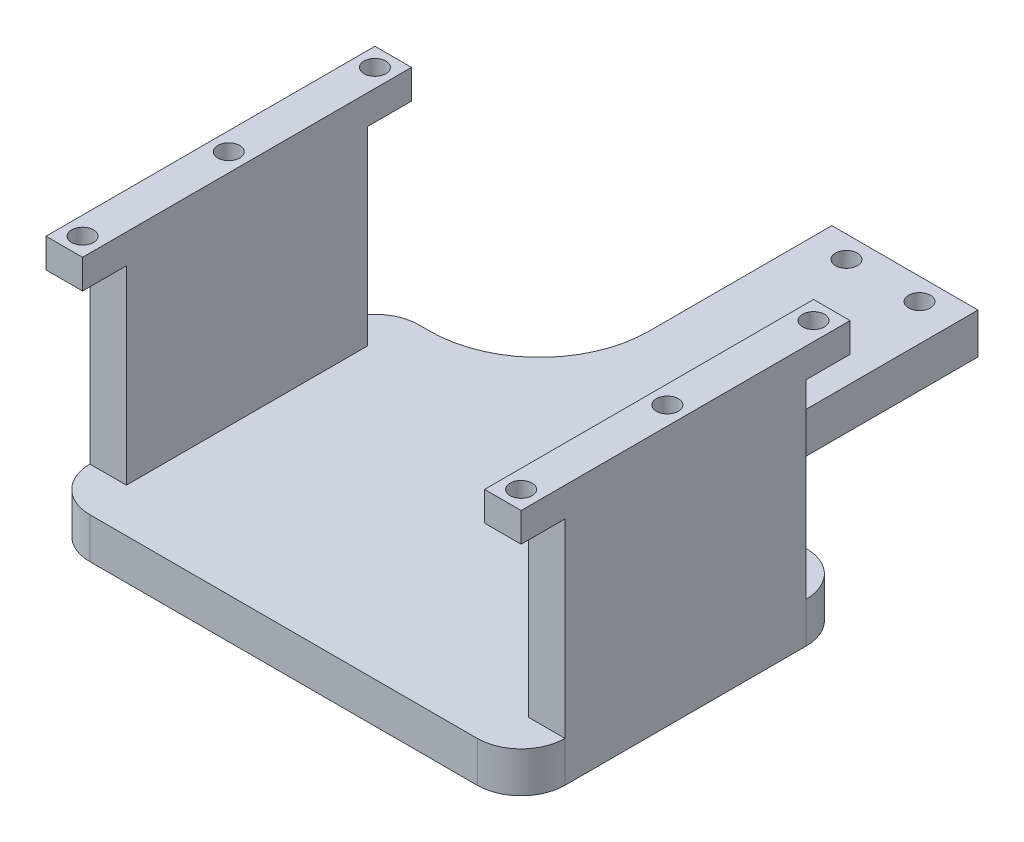
ISO-10303-21;
HEADER;
FILE_DESCRIPTION(('STEP AP214'),'2;1');
FILE_NAME('part.step','',(''),(''),'','','');
FILE_SCHEMA(('AUTOMOTIVE_DESIGN { 1 0 10303 214 1 1 1 1 }'));
ENDSEC;
DATA;
#1=APPLICATION_CONTEXT('core data for automotive mechanical design processes');
#2=APPLICATION_PROTOCOL_DEFINITION('international standard','automotive_design',2000,#1);
#3=PRODUCT_CONTEXT('',#1,'mechanical');
#4=PRODUCT('Part','Part','',(#3));
#5=PRODUCT_RELATED_PRODUCT_CATEGORY('part','',(#4));
#6=PRODUCT_DEFINITION_FORMATION('','',#4);
#7=PRODUCT_DEFINITION_CONTEXT('part definition',#1,'design');
#8=PRODUCT_DEFINITION('design','',#6,#7);
#9=PRODUCT_DEFINITION_SHAPE('','',#8);
#10=(LENGTH_UNIT() NAMED_UNIT(*) SI_UNIT(.MILLI.,.METRE.));
#11=(NAMED_UNIT(*) PLANE_ANGLE_UNIT() SI_UNIT($,.RADIAN.));
#12=(NAMED_UNIT(*) SI_UNIT($,.STERADIAN.) SOLID_ANGLE_UNIT());
#13=UNCERTAINTY_MEASURE_WITH_UNIT(LENGTH_MEASURE(1.E-05),#10,'distance_accuracy_value','');
#14=(GEOMETRIC_REPRESENTATION_CONTEXT(3) GLOBAL_UNCERTAINTY_ASSIGNED_CONTEXT((#13)) GLOBAL_UNIT_ASSIGNED_CONTEXT((#10,
#11,#12)) REPRESENTATION_CONTEXT('',''));
#15=CARTESIAN_POINT('',(0.,0.,0.));
#16=DIRECTION('',(0.,0.,1.));
#17=DIRECTION('',(1.,0.,0.));
#18=AXIS2_PLACEMENT_3D('',#15,#16,#17);
#19=CARTESIAN_POINT('',(0.,5.56,22.5));
#20=DIRECTION('',(0.,0.,-1.));
#21=DIRECTION('',(-1.,0.,0.));
#22=AXIS2_PLACEMENT_3D('',#19,#20,#21);
#23=PLANE('',#22);
#24=DIRECTION('',(1.,0.,0.));
#25=VECTOR('',#24,1.);
#26=CARTESIAN_POINT('',(0.,5.56,22.5));
#27=LINE('',#26,#25);
#28=CARTESIAN_POINT('',(-26.5,5.56,22.5));
#29=VERTEX_POINT('',#28);
#30=CARTESIAN_POINT('',(26.5,5.56,22.5));
#31=VERTEX_POINT('',#30);
#32=EDGE_CURVE('E312',#29,#31,#27,.T.);
#33=ORIENTED_EDGE('',*,*,#32,.F.);
#34=DIRECTION('',(0.,-1.,0.));
#35=VECTOR('',#34,1.);
#36=CARTESIAN_POINT('',(-26.5,0.,22.5));
#37=LINE('',#36,#35);
#38=CARTESIAN_POINT('',(-26.5,0.,22.5));
#39=VERTEX_POINT('',#38);
#40=EDGE_CURVE('E237',#29,#39,#37,.T.);
#41=ORIENTED_EDGE('',*,*,#40,.T.);
#42=DIRECTION('',(1.,0.,0.));
#43=VECTOR('',#42,1.);
#44=CARTESIAN_POINT('',(0.,0.,22.5));
#45=LINE('',#44,#43);
#46=CARTESIAN_POINT('',(26.5,0.,22.5));
#47=VERTEX_POINT('',#46);
#48=EDGE_CURVE('E289',#39,#47,#45,.T.);
#49=ORIENTED_EDGE('',*,*,#48,.T.);
#50=DIRECTION('',(0.,-1.,0.));
#51=VECTOR('',#50,1.);
#52=CARTESIAN_POINT('',(26.5,5.56,22.5));
#53=LINE('',#52,#51);
#54=EDGE_CURVE('E60',#47,#31,#53,.F.);
#55=ORIENTED_EDGE('',*,*,#54,.T.);
#56=EDGE_LOOP('',(#33,#41,#49,#55));
#57=FACE_BOUND('',#56,.T.);
#58=ADVANCED_FACE('F37',(#57),#23,.F.);
#59=DIRECTION('',(0.,-1.,0.));
#60=VECTOR('',#59,1.);
#61=CARTESIAN_POINT('',(-32.5,5.56,22.5));
#62=LINE('',#61,#60);
#63=CARTESIAN_POINT('',(-32.5,35.56,22.5));
#64=VERTEX_POINT('',#63);
#65=CARTESIAN_POINT('',(-32.5,31.56,22.5));
#66=VERTEX_POINT('',#65);
#67=EDGE_CURVE('E313',#64,#66,#62,.T.);
#68=ORIENTED_EDGE('',*,*,#67,.T.);
#69=DIRECTION('',(-1.,0.,0.));
#70=VECTOR('',#69,1.);
#71=CARTESIAN_POINT('',(32.5,31.56,22.5));
#72=LINE('',#71,#70);
#73=CARTESIAN_POINT('',(-27.5,31.56,22.5));
#74=VERTEX_POINT('',#73);
#75=EDGE_CURVE('E1107',#74,#66,#72,.T.);
#76=ORIENTED_EDGE('',*,*,#75,.F.);
#77=DIRECTION('',(0.,-1.,0.));
#78=VECTOR('',#77,1.);
#79=CARTESIAN_POINT('',(-27.5,110.836925690687,22.5));
#80=LINE('',#79,#78);
#81=CARTESIAN_POINT('',(-27.5,35.56,22.5));
#82=VERTEX_POINT('',#81);
#83=EDGE_CURVE('E455',#82,#74,#80,.T.);
#84=ORIENTED_EDGE('',*,*,#83,.F.);
#85=DIRECTION('',(1.,0.,0.));
#86=VECTOR('',#85,1.);
#87=CARTESIAN_POINT('',(0.,35.56,22.5));
#88=LINE('',#87,#86);
#89=EDGE_CURVE('E442',#64,#82,#88,.T.);
#90=ORIENTED_EDGE('',*,*,#89,.F.);
#91=EDGE_LOOP('',(#68,#76,#84,#90));
#92=FACE_BOUND('',#91,.T.);
#93=ADVANCED_FACE('F513',(#92),#23,.F.);
#94=CARTESIAN_POINT('',(0.,5.56,-22.5));
#95=DIRECTION('',(0.,0.,-1.));
#96=DIRECTION('',(-1.,0.,0.));
#97=AXIS2_PLACEMENT_3D('',#94,#95,#96);
#98=PLANE('',#97);
#99=DIRECTION('',(-1.,0.,0.));
#100=VECTOR('',#99,1.);
#101=CARTESIAN_POINT('',(32.5,31.56,-22.5));
#102=LINE('',#101,#100);
#103=CARTESIAN_POINT('',(32.5,31.56,-22.5));
#104=VERTEX_POINT('',#103);
#105=CARTESIAN_POINT('',(27.5,31.56,-22.5));
#106=VERTEX_POINT('',#105);
#107=EDGE_CURVE('E337',#104,#106,#102,.T.);
#108=ORIENTED_EDGE('',*,*,#107,.T.);
#109=DIRECTION('',(0.,-1.,0.));
#110=VECTOR('',#109,1.);
#111=CARTESIAN_POINT('',(27.5,110.836925690687,-22.5));
#112=LINE('',#111,#110);
#113=CARTESIAN_POINT('',(27.5,35.56,-22.5));
#114=VERTEX_POINT('',#113);
#115=EDGE_CURVE('E406',#114,#106,#112,.T.);
#116=ORIENTED_EDGE('',*,*,#115,.F.);
#117=DIRECTION('',(1.,0.,0.));
#118=VECTOR('',#117,1.);
#119=CARTESIAN_POINT('',(0.,35.56,-22.5));
#120=LINE('',#119,#118);
#121=CARTESIAN_POINT('',(32.5,35.56,-22.5));
#122=VERTEX_POINT('',#121);
#123=EDGE_CURVE('E403',#114,#122,#120,.T.);
#124=ORIENTED_EDGE('',*,*,#123,.T.);
#125=DIRECTION('',(0.,-1.,0.));
#126=VECTOR('',#125,1.);
#127=CARTESIAN_POINT('',(32.5,5.56,-22.5));
#128=LINE('',#127,#126);
#129=EDGE_CURVE('E326',#122,#104,#128,.T.);
#130=ORIENTED_EDGE('',*,*,#129,.T.);
#131=EDGE_LOOP('',(#108,#116,#124,#130));
#132=FACE_BOUND('',#131,.T.);
#133=ADVANCED_FACE('F521',(#132),#98,.T.);
#134=CARTESIAN_POINT('',(-27.5,31.56,-22.5));
#135=VERTEX_POINT('',#134);
#136=CARTESIAN_POINT('',(-32.5,31.56,-22.5));
#137=VERTEX_POINT('',#136);
#138=EDGE_CURVE('E1105',#135,#137,#102,.T.);
#139=ORIENTED_EDGE('',*,*,#138,.T.);
#140=DIRECTION('',(0.,-1.,0.));
#141=VECTOR('',#140,1.);
#142=CARTESIAN_POINT('',(-32.5,5.56,-22.5));
#143=LINE('',#142,#141);
#144=CARTESIAN_POINT('',(-32.5,35.56,-22.5));
#145=VERTEX_POINT('',#144);
#146=EDGE_CURVE('E316',#145,#137,#143,.T.);
#147=ORIENTED_EDGE('',*,*,#146,.F.);
#148=DIRECTION('',(1.,0.,0.));
#149=VECTOR('',#148,1.);
#150=CARTESIAN_POINT('',(0.,35.56,-22.5));
#151=LINE('',#150,#149);
#152=CARTESIAN_POINT('',(-27.5,35.56,-22.5));
#153=VERTEX_POINT('',#152);
#154=EDGE_CURVE('E453',#145,#153,#151,.T.);
#155=ORIENTED_EDGE('',*,*,#154,.T.);
#156=DIRECTION('',(0.,-1.,0.));
#157=VECTOR('',#156,1.);
#158=CARTESIAN_POINT('',(-27.5,110.836925690687,-22.5));
#159=LINE('',#158,#157);
#160=EDGE_CURVE('E452',#153,#135,#159,.T.);
#161=ORIENTED_EDGE('',*,*,#160,.T.);
#162=EDGE_LOOP('',(#139,#147,#155,#161));
#163=FACE_BOUND('',#162,.T.);
#164=ADVANCED_FACE('F526',(#163),#98,.T.);
#165=DIRECTION('',(0.,-1.,0.));
#166=VECTOR('',#165,1.);
#167=CARTESIAN_POINT('',(27.5,110.836925690687,22.5));
#168=LINE('',#167,#166);
#169=CARTESIAN_POINT('',(27.5,35.56,22.5));
#170=VERTEX_POINT('',#169);
#171=CARTESIAN_POINT('',(27.5,31.56,22.5));
#172=VERTEX_POINT('',#171);
#173=EDGE_CURVE('E422',#170,#172,#168,.T.);
#174=ORIENTED_EDGE('',*,*,#173,.T.);
#175=CARTESIAN_POINT('',(32.5,31.56,22.5));
#176=VERTEX_POINT('',#175);
#177=EDGE_CURVE('E537',#176,#172,#72,.T.);
#178=ORIENTED_EDGE('',*,*,#177,.F.);
#179=DIRECTION('',(0.,-1.,0.));
#180=VECTOR('',#179,1.);
#181=CARTESIAN_POINT('',(32.5,5.56,22.5));
#182=LINE('',#181,#180);
#183=CARTESIAN_POINT('',(32.5,35.56,22.5));
#184=VERTEX_POINT('',#183);
#185=EDGE_CURVE('E329',#184,#176,#182,.T.);
#186=ORIENTED_EDGE('',*,*,#185,.F.);
#187=DIRECTION('',(1.,0.,0.));
#188=VECTOR('',#187,1.);
#189=CARTESIAN_POINT('',(0.,35.56,22.5));
#190=LINE('',#189,#188);
#191=EDGE_CURVE('E423',#170,#184,#190,.T.);
#192=ORIENTED_EDGE('',*,*,#191,.F.);
#193=EDGE_LOOP('',(#174,#178,#186,#192));
#194=FACE_BOUND('',#193,.T.);
#195=ADVANCED_FACE('F515',(#194),#23,.F.);
#196=CARTESIAN_POINT('',(32.5,5.56,0.));
#197=DIRECTION('',(-1.,0.,0.));
#198=DIRECTION('',(0.,0.,1.));
#199=AXIS2_PLACEMENT_3D('',#196,#197,#198);
#200=PLANE('',#199);
#201=DIRECTION('',(0.,-1.,0.));
#202=VECTOR('',#201,1.);
#203=CARTESIAN_POINT('',(32.5,5.56,16.5));
#204=LINE('',#203,#202);
#205=CARTESIAN_POINT('',(32.5,31.56,16.5));
#206=VERTEX_POINT('',#205);
#207=CARTESIAN_POINT('',(32.5,5.56,16.5));
#208=VERTEX_POINT('',#207);
#209=EDGE_CURVE('E277',#206,#208,#204,.T.);
#210=ORIENTED_EDGE('',*,*,#209,.T.);
#211=DIRECTION('',(0.,-1.,0.));
#212=VECTOR('',#211,1.);
#213=CARTESIAN_POINT('',(32.5,5.56,16.5));
#214=LINE('',#213,#212);
#215=CARTESIAN_POINT('',(32.5,0.,16.5));
#216=VERTEX_POINT('',#215);
#217=EDGE_CURVE('E45',#208,#216,#214,.T.);
#218=ORIENTED_EDGE('',*,*,#217,.T.);
#219=DIRECTION('',(0.,0.,-1.));
#220=VECTOR('',#219,1.);
#221=CARTESIAN_POINT('',(32.5,0.,0.));
#222=LINE('',#221,#220);
#223=CARTESIAN_POINT('',(32.5,0.,-16.5));
#224=VERTEX_POINT('',#223);
#225=EDGE_CURVE('E235',#216,#224,#222,.T.);
#226=ORIENTED_EDGE('',*,*,#225,.T.);
#227=DIRECTION('',(0.,-1.,0.));
#228=VECTOR('',#227,1.);
#229=CARTESIAN_POINT('',(32.5,5.56,-16.5));
#230=LINE('',#229,#228);
#231=CARTESIAN_POINT('',(32.5,5.56,-16.5));
#232=VERTEX_POINT('',#231);
#233=EDGE_CURVE('E227',#224,#232,#230,.F.);
#234=ORIENTED_EDGE('',*,*,#233,.T.);
#235=DIRECTION('',(0.,1.,0.));
#236=VECTOR('',#235,1.);
#237=CARTESIAN_POINT('',(32.5,5.56,-16.5));
#238=LINE('',#237,#236);
#239=CARTESIAN_POINT('',(32.5,31.56,-16.5));
#240=VERTEX_POINT('',#239);
#241=EDGE_CURVE('E232',#232,#240,#238,.T.);
#242=ORIENTED_EDGE('',*,*,#241,.T.);
#243=DIRECTION('',(0.,0.,-1.));
#244=VECTOR('',#243,1.);
#245=CARTESIAN_POINT('',(32.5,31.56,-16.5));
#246=LINE('',#245,#244);
#247=EDGE_CURVE('E256',#240,#104,#246,.T.);
#248=ORIENTED_EDGE('',*,*,#247,.T.);
#249=ORIENTED_EDGE('',*,*,#129,.F.);
#250=DIRECTION('',(0.,0.,-1.));
#251=VECTOR('',#250,1.);
#252=CARTESIAN_POINT('',(32.5,35.56,0.));
#253=LINE('',#252,#251);
#254=EDGE_CURVE('E426',#184,#122,#253,.T.);
#255=ORIENTED_EDGE('',*,*,#254,.F.);
#256=ORIENTED_EDGE('',*,*,#185,.T.);
#257=DIRECTION('',(0.,0.,-1.));
#258=VECTOR('',#257,1.);
#259=CARTESIAN_POINT('',(32.5,31.56,16.5));
#260=LINE('',#259,#258);
#261=EDGE_CURVE('E1108',#176,#206,#260,.T.);
#262=ORIENTED_EDGE('',*,*,#261,.T.);
#263=EDGE_LOOP('',(#210,#218,#226,#234,#242,#248,#249,#255,#256,#262));
#264=FACE_BOUND('',#263,.T.);
#265=ADVANCED_FACE('F229',(#264),#200,.F.);
#266=DIRECTION('',(1.,0.,0.));
#267=VECTOR('',#266,1.);
#268=CARTESIAN_POINT('',(0.,5.56,-22.5));
#269=LINE('',#268,#267);
#270=CARTESIAN_POINT('',(25.,5.56,-22.5));
#271=VERTEX_POINT('',#270);
#272=CARTESIAN_POINT('',(26.5,5.56,-22.5));
#273=VERTEX_POINT('',#272);
#274=EDGE_CURVE('E468',#271,#273,#269,.T.);
#275=ORIENTED_EDGE('',*,*,#274,.T.);
#276=DIRECTION('',(0.,-1.,0.));
#277=VECTOR('',#276,1.);
#278=CARTESIAN_POINT('',(26.5,0.,-22.5));
#279=LINE('',#278,#277);
#280=CARTESIAN_POINT('',(26.5,0.,-22.5));
#281=VERTEX_POINT('',#280);
#282=EDGE_CURVE('E12',#273,#281,#279,.T.);
#283=ORIENTED_EDGE('',*,*,#282,.T.);
#284=DIRECTION('',(1.,0.,0.));
#285=VECTOR('',#284,1.);
#286=CARTESIAN_POINT('',(0.,0.,-22.5));
#287=LINE('',#286,#285);
#288=CARTESIAN_POINT('',(25.,0.,-22.5));
#289=VERTEX_POINT('',#288);
#290=EDGE_CURVE('E288',#289,#281,#287,.T.);
#291=ORIENTED_EDGE('',*,*,#290,.F.);
#292=DIRECTION('',(0.,-1.,0.));
#293=VECTOR('',#292,1.);
#294=CARTESIAN_POINT('',(25.,5.56,-22.5));
#295=LINE('',#294,#293);
#296=EDGE_CURVE('E352',#289,#271,#295,.F.);
#297=ORIENTED_EDGE('',*,*,#296,.T.);
#298=EDGE_LOOP('',(#275,#283,#291,#297));
#299=FACE_BOUND('',#298,.T.);
#300=ADVANCED_FACE('F532',(#299),#98,.T.);
#301=CARTESIAN_POINT('',(9.99999999999999,5.56,0.));
#302=DIRECTION('',(-1.,0.,0.));
#303=DIRECTION('',(0.,0.,1.));
#304=AXIS2_PLACEMENT_3D('',#301,#302,#303);
#305=PLANE('',#304);
#306=DIRECTION('',(0.,0.,-1.));
#307=VECTOR('',#306,1.);
#308=CARTESIAN_POINT('',(9.99999999999999,5.56,0.));
#309=LINE('',#308,#307);
#310=CARTESIAN_POINT('',(9.99999999999999,5.56,-37.5));
#311=VERTEX_POINT('',#310);
#312=CARTESIAN_POINT('',(9.99999999999999,5.56,-62.5));
#313=VERTEX_POINT('',#312);
#314=EDGE_CURVE('E470',#311,#313,#309,.T.);
#315=ORIENTED_EDGE('',*,*,#314,.F.);
#316=DIRECTION('',(0.,-1.,0.));
#317=VECTOR('',#316,1.);
#318=CARTESIAN_POINT('',(9.99999999999999,5.56,-37.5));
#319=LINE('',#318,#317);
#320=CARTESIAN_POINT('',(9.99999999999999,0.,-37.5));
#321=VERTEX_POINT('',#320);
#322=EDGE_CURVE('E349',#311,#321,#319,.T.);
#323=ORIENTED_EDGE('',*,*,#322,.T.);
#324=DIRECTION('',(0.,0.,-1.));
#325=VECTOR('',#324,1.);
#326=CARTESIAN_POINT('',(9.99999999999999,0.,0.));
#327=LINE('',#326,#325);
#328=CARTESIAN_POINT('',(9.99999999999999,0.,-62.5));
#329=VERTEX_POINT('',#328);
#330=EDGE_CURVE('E291',#321,#329,#327,.T.);
#331=ORIENTED_EDGE('',*,*,#330,.T.);
#332=DIRECTION('',(0.,-1.,0.));
#333=VECTOR('',#332,1.);
#334=CARTESIAN_POINT('',(9.99999999999999,5.56,-62.5));
#335=LINE('',#334,#333);
#336=EDGE_CURVE('E323',#313,#329,#335,.T.);
#337=ORIENTED_EDGE('',*,*,#336,.F.);
#338=EDGE_LOOP('',(#315,#323,#331,#337));
#339=FACE_BOUND('',#338,.T.);
#340=ADVANCED_FACE('F616',(#339),#305,.F.);
#341=CARTESIAN_POINT('',(0.,5.56,-62.5));
#342=DIRECTION('',(0.,0.,-1.));
#343=DIRECTION('',(-1.,0.,0.));
#344=AXIS2_PLACEMENT_3D('',#341,#342,#343);
#345=PLANE('',#344);
#346=DIRECTION('',(1.,0.,0.));
#347=VECTOR('',#346,1.);
#348=CARTESIAN_POINT('',(0.,0.,-62.5));
#349=LINE('',#348,#347);
#350=CARTESIAN_POINT('',(-10.,0.,-62.5));
#351=VERTEX_POINT('',#350);
#352=EDGE_CURVE('E299',#351,#329,#349,.T.);
#353=ORIENTED_EDGE('',*,*,#352,.F.);
#354=DIRECTION('',(0.,-1.,0.));
#355=VECTOR('',#354,1.);
#356=CARTESIAN_POINT('',(-10.,5.56,-62.5));
#357=LINE('',#356,#355);
#358=CARTESIAN_POINT('',(-10.,5.56,-62.5));
#359=VERTEX_POINT('',#358);
#360=EDGE_CURVE('E320',#359,#351,#357,.T.);
#361=ORIENTED_EDGE('',*,*,#360,.F.);
#362=DIRECTION('',(1.,0.,0.));
#363=VECTOR('',#362,1.);
#364=CARTESIAN_POINT('',(0.,5.56,-62.5));
#365=LINE('',#364,#363);
#366=EDGE_CURVE('E472',#359,#313,#365,.T.);
#367=ORIENTED_EDGE('',*,*,#366,.T.);
#368=ORIENTED_EDGE('',*,*,#336,.T.);
#369=EDGE_LOOP('',(#353,#361,#367,#368));
#370=FACE_BOUND('',#369,.T.);
#371=ADVANCED_FACE('F621',(#370),#345,.T.);
#372=CARTESIAN_POINT('',(-10.,5.56,0.));
#373=DIRECTION('',(-1.,0.,0.));
#374=DIRECTION('',(0.,0.,1.));
#375=AXIS2_PLACEMENT_3D('',#372,#373,#374);
#376=PLANE('',#375);
#377=DIRECTION('',(0.,0.,-1.));
#378=VECTOR('',#377,1.);
#379=CARTESIAN_POINT('',(-10.,0.,0.));
#380=LINE('',#379,#378);
#381=CARTESIAN_POINT('',(-10.,0.,-37.5));
#382=VERTEX_POINT('',#381);
#383=EDGE_CURVE('E302',#382,#351,#380,.T.);
#384=ORIENTED_EDGE('',*,*,#383,.F.);
#385=DIRECTION('',(0.,-1.,0.));
#386=VECTOR('',#385,1.);
#387=CARTESIAN_POINT('',(-10.,5.56,-37.5));
#388=LINE('',#387,#386);
#389=CARTESIAN_POINT('',(-10.,5.56,-37.5));
#390=VERTEX_POINT('',#389);
#391=EDGE_CURVE('E357',#382,#390,#388,.F.);
#392=ORIENTED_EDGE('',*,*,#391,.T.);
#393=DIRECTION('',(0.,0.,-1.));
#394=VECTOR('',#393,1.);
#395=CARTESIAN_POINT('',(-10.,5.56,0.));
#396=LINE('',#395,#394);
#397=EDGE_CURVE('E475',#390,#359,#396,.T.);
#398=ORIENTED_EDGE('',*,*,#397,.T.);
#399=ORIENTED_EDGE('',*,*,#360,.T.);
#400=EDGE_LOOP('',(#384,#392,#398,#399));
#401=FACE_BOUND('',#400,.T.);
#402=ADVANCED_FACE('F627',(#401),#376,.T.);
#403=CARTESIAN_POINT('',(-26.5,0.,-22.5));
#404=VERTEX_POINT('',#403);
#405=CARTESIAN_POINT('',(-25.,0.,-22.5));
#406=VERTEX_POINT('',#405);
#407=EDGE_CURVE('E293',#404,#406,#287,.T.);
#408=ORIENTED_EDGE('',*,*,#407,.F.);
#409=DIRECTION('',(0.,-1.,0.));
#410=VECTOR('',#409,1.);
#411=CARTESIAN_POINT('',(-26.5,5.56,-22.5));
#412=LINE('',#411,#410);
#413=CARTESIAN_POINT('',(-26.5,5.56,-22.5));
#414=VERTEX_POINT('',#413);
#415=EDGE_CURVE('E261',#404,#414,#412,.F.);
#416=ORIENTED_EDGE('',*,*,#415,.T.);
#417=CARTESIAN_POINT('',(-25.,5.56,-22.5));
#418=VERTEX_POINT('',#417);
#419=EDGE_CURVE('E390',#414,#418,#269,.T.);
#420=ORIENTED_EDGE('',*,*,#419,.T.);
#421=DIRECTION('',(0.,-1.,0.));
#422=VECTOR('',#421,1.);
#423=CARTESIAN_POINT('',(-25.,0.,-22.5));
#424=LINE('',#423,#422);
#425=EDGE_CURVE('E354',#418,#406,#424,.T.);
#426=ORIENTED_EDGE('',*,*,#425,.T.);
#427=EDGE_LOOP('',(#408,#416,#420,#426));
#428=FACE_BOUND('',#427,.T.);
#429=ADVANCED_FACE('F383',(#428),#98,.T.);
#430=CARTESIAN_POINT('',(5.,5.56,-59.5));
#431=DIRECTION('',(0.,-1.,0.));
#432=DIRECTION('',(0.,0.,-1.));
#433=AXIS2_PLACEMENT_3D('',#430,#431,#432);
#434=CYLINDRICAL_SURFACE('',#433,1.5);
#435=CARTESIAN_POINT('',(5.,5.56,-59.5));
#436=DIRECTION('',(0.,1.,0.));
#437=DIRECTION('',(0.,0.,1.));
#438=AXIS2_PLACEMENT_3D('',#435,#436,#437);
#439=CIRCLE('',#438,1.5);
#440=CARTESIAN_POINT('',(5.,5.56,-58.));
#441=VERTEX_POINT('',#440);
#442=EDGE_CURVE('E477',#441,#441,#439,.T.);
#443=ORIENTED_EDGE('',*,*,#442,.T.);
#444=EDGE_LOOP('',(#443));
#445=FACE_BOUND('',#444,.T.);
#446=CARTESIAN_POINT('',(5.,0.,-59.5));
#447=DIRECTION('',(0.,1.,0.));
#448=DIRECTION('',(0.,0.,1.));
#449=AXIS2_PLACEMENT_3D('',#446,#447,#448);
#450=CIRCLE('',#449,1.5);
#451=CARTESIAN_POINT('',(5.,0.,-58.));
#452=VERTEX_POINT('',#451);
#453=EDGE_CURVE('E306',#452,#452,#450,.T.);
#454=ORIENTED_EDGE('',*,*,#453,.F.);
#455=EDGE_LOOP('',(#454));
#456=FACE_BOUND('',#455,.T.);
#457=ADVANCED_FACE('F493',(#445,#456),#434,.F.);
#458=CARTESIAN_POINT('',(-32.5,5.56,0.));
#459=DIRECTION('',(-1.,0.,0.));
#460=DIRECTION('',(0.,0.,1.));
#461=AXIS2_PLACEMENT_3D('',#458,#459,#460);
#462=PLANE('',#461);
#463=DIRECTION('',(0.,1.,0.));
#464=VECTOR('',#463,1.);
#465=CARTESIAN_POINT('',(-32.5,5.56,-16.5));
#466=LINE('',#465,#464);
#467=CARTESIAN_POINT('',(-32.5,5.56,-16.5));
#468=VERTEX_POINT('',#467);
#469=CARTESIAN_POINT('',(-32.5,31.56,-16.5));
#470=VERTEX_POINT('',#469);
#471=EDGE_CURVE('E395',#468,#470,#466,.T.);
#472=ORIENTED_EDGE('',*,*,#471,.F.);
#473=DIRECTION('',(0.,-1.,0.));
#474=VECTOR('',#473,1.);
#475=CARTESIAN_POINT('',(-32.5,5.56,-16.5));
#476=LINE('',#475,#474);
#477=CARTESIAN_POINT('',(-32.5,0.,-16.5));
#478=VERTEX_POINT('',#477);
#479=EDGE_CURVE('E370',#468,#478,#476,.T.);
#480=ORIENTED_EDGE('',*,*,#479,.T.);
#481=DIRECTION('',(0.,0.,-1.));
#482=VECTOR('',#481,1.);
#483=CARTESIAN_POINT('',(-32.5,0.,0.));
#484=LINE('',#483,#482);
#485=CARTESIAN_POINT('',(-32.5,0.,16.5));
#486=VERTEX_POINT('',#485);
#487=EDGE_CURVE('E304',#486,#478,#484,.T.);
#488=ORIENTED_EDGE('',*,*,#487,.F.);
#489=DIRECTION('',(0.,-1.,0.));
#490=VECTOR('',#489,1.);
#491=CARTESIAN_POINT('',(-32.5,5.56,16.5));
#492=LINE('',#491,#490);
#493=CARTESIAN_POINT('',(-32.5,5.56,16.5));
#494=VERTEX_POINT('',#493);
#495=EDGE_CURVE('E368',#486,#494,#492,.F.);
#496=ORIENTED_EDGE('',*,*,#495,.T.);
#497=DIRECTION('',(0.,-1.,0.));
#498=VECTOR('',#497,1.);
#499=CARTESIAN_POINT('',(-32.5,5.56,16.5));
#500=LINE('',#499,#498);
#501=CARTESIAN_POINT('',(-32.5,31.56,16.5));
#502=VERTEX_POINT('',#501);
#503=EDGE_CURVE('E408',#502,#494,#500,.T.);
#504=ORIENTED_EDGE('',*,*,#503,.F.);
#505=DIRECTION('',(0.,0.,-1.));
#506=VECTOR('',#505,1.);
#507=CARTESIAN_POINT('',(-32.5,31.56,0.));
#508=LINE('',#507,#506);
#509=EDGE_CURVE('E566',#66,#502,#508,.T.);
#510=ORIENTED_EDGE('',*,*,#509,.F.);
#511=ORIENTED_EDGE('',*,*,#67,.F.);
#512=DIRECTION('',(0.,0.,-1.));
#513=VECTOR('',#512,1.);
#514=CARTESIAN_POINT('',(-32.5,35.56,0.));
#515=LINE('',#514,#513);
#516=EDGE_CURVE('E449',#64,#145,#515,.T.);
#517=ORIENTED_EDGE('',*,*,#516,.T.);
#518=ORIENTED_EDGE('',*,*,#146,.T.);
#519=DIRECTION('',(0.,0.,-1.));
#520=VECTOR('',#519,1.);
#521=CARTESIAN_POINT('',(-32.5,31.56,0.));
#522=LINE('',#521,#520);
#523=EDGE_CURVE('E342',#470,#137,#522,.T.);
#524=ORIENTED_EDGE('',*,*,#523,.F.);
#525=EDGE_LOOP('',(#472,#480,#488,#496,#504,#510,#511,#517,#518,#524));
#526=FACE_BOUND('',#525,.T.);
#527=ADVANCED_FACE('F402',(#526),#462,.T.);
#528=CARTESIAN_POINT('',(-5.,5.56,-59.5));
#529=DIRECTION('',(0.,-1.,0.));
#530=DIRECTION('',(0.,0.,-1.));
#531=AXIS2_PLACEMENT_3D('',#528,#529,#530);
#532=CYLINDRICAL_SURFACE('',#531,1.5);
#533=CARTESIAN_POINT('',(-5.,5.56,-59.5));
#534=DIRECTION('',(0.,1.,0.));
#535=DIRECTION('',(0.,0.,1.));
#536=AXIS2_PLACEMENT_3D('',#533,#534,#535);
#537=CIRCLE('',#536,1.5);
#538=CARTESIAN_POINT('',(-5.,5.56,-58.));
#539=VERTEX_POINT('',#538);
#540=EDGE_CURVE('E317',#539,#539,#537,.T.);
#541=ORIENTED_EDGE('',*,*,#540,.T.);
#542=EDGE_LOOP('',(#541));
#543=FACE_BOUND('',#542,.T.);
#544=CARTESIAN_POINT('',(-5.,0.,-59.5));
#545=DIRECTION('',(0.,1.,0.));
#546=DIRECTION('',(0.,0.,1.));
#547=AXIS2_PLACEMENT_3D('',#544,#545,#546);
#548=CIRCLE('',#547,1.5);
#549=CARTESIAN_POINT('',(-5.,0.,-58.));
#550=VERTEX_POINT('',#549);
#551=EDGE_CURVE('E309',#550,#550,#548,.T.);
#552=ORIENTED_EDGE('',*,*,#551,.F.);
#553=EDGE_LOOP('',(#552));
#554=FACE_BOUND('',#553,.T.);
#555=ADVANCED_FACE('F482',(#543,#554),#532,.F.);
#556=CARTESIAN_POINT('',(0.,0.,0.));
#557=DIRECTION('',(0.,1.,0.));
#558=DIRECTION('',(0.,0.,1.));
#559=AXIS2_PLACEMENT_3D('',#556,#557,#558);
#560=PLANE('',#559);
#561=ORIENTED_EDGE('',*,*,#487,.T.);
#562=CARTESIAN_POINT('',(-26.5,0.,-16.5));
#563=DIRECTION('',(0.,1.,0.));
#564=DIRECTION('',(0.,0.,1.));
#565=AXIS2_PLACEMENT_3D('',#562,#563,#564);
#566=CIRCLE('',#565,6.);
#567=EDGE_CURVE('E265',#478,#404,#566,.F.);
#568=ORIENTED_EDGE('',*,*,#567,.T.);
#569=ORIENTED_EDGE('',*,*,#407,.T.);
#570=CARTESIAN_POINT('',(-25.,0.,-37.5));
#571=DIRECTION('',(0.,1.,0.));
#572=DIRECTION('',(0.,0.,1.));
#573=AXIS2_PLACEMENT_3D('',#570,#571,#572);
#574=CIRCLE('',#573,15.);
#575=EDGE_CURVE('E363',#406,#382,#574,.T.);
#576=ORIENTED_EDGE('',*,*,#575,.T.);
#577=ORIENTED_EDGE('',*,*,#383,.T.);
#578=ORIENTED_EDGE('',*,*,#352,.T.);
#579=ORIENTED_EDGE('',*,*,#330,.F.);
#580=CARTESIAN_POINT('',(25.,0.,-37.5));
#581=DIRECTION('',(0.,1.,0.));
#582=DIRECTION('',(0.,0.,1.));
#583=AXIS2_PLACEMENT_3D('',#580,#581,#582);
#584=CIRCLE('',#583,15.);
#585=EDGE_CURVE('E359',#321,#289,#584,.T.);
#586=ORIENTED_EDGE('',*,*,#585,.T.);
#587=ORIENTED_EDGE('',*,*,#290,.T.);
#588=CARTESIAN_POINT('',(26.5,0.,-16.5));
#589=DIRECTION('',(0.,1.,0.));
#590=DIRECTION('',(0.,0.,1.));
#591=AXIS2_PLACEMENT_3D('',#588,#589,#590);
#592=CIRCLE('',#591,6.);
#593=EDGE_CURVE('E287',#281,#224,#592,.F.);
#594=ORIENTED_EDGE('',*,*,#593,.T.);
#595=ORIENTED_EDGE('',*,*,#225,.F.);
#596=CARTESIAN_POINT('',(26.5,0.,16.5));
#597=DIRECTION('',(0.,1.,0.));
#598=DIRECTION('',(0.,0.,1.));
#599=AXIS2_PLACEMENT_3D('',#596,#597,#598);
#600=CIRCLE('',#599,6.);
#601=EDGE_CURVE('E285',#216,#47,#600,.F.);
#602=ORIENTED_EDGE('',*,*,#601,.T.);
#603=ORIENTED_EDGE('',*,*,#48,.F.);
#604=CARTESIAN_POINT('',(-26.5,0.,16.5));
#605=DIRECTION('',(0.,1.,0.));
#606=DIRECTION('',(0.,0.,1.));
#607=AXIS2_PLACEMENT_3D('',#604,#605,#606);
#608=CIRCLE('',#607,6.);
#609=EDGE_CURVE('E375',#39,#486,#608,.F.);
#610=ORIENTED_EDGE('',*,*,#609,.T.);
#611=EDGE_LOOP('',(#561,#568,#569,#576,#577,#578,#579,#586,#587,#594,#595,#602,#603,#610));
#612=FACE_BOUND('',#611,.T.);
#613=ORIENTED_EDGE('',*,*,#551,.T.);
#614=EDGE_LOOP('',(#613));
#615=FACE_BOUND('',#614,.T.);
#616=ORIENTED_EDGE('',*,*,#453,.T.);
#617=EDGE_LOOP('',(#616));
#618=FACE_BOUND('',#617,.T.);
#619=ADVANCED_FACE('F282',(#612,#615,#618),#560,.F.);
#620=CARTESIAN_POINT('',(-27.5,110.836925690687,0.));
#621=DIRECTION('',(1.,0.,0.));
#622=DIRECTION('',(0.,0.,-1.));
#623=AXIS2_PLACEMENT_3D('',#620,#621,#622);
#624=PLANE('',#623);
#625=DIRECTION('',(0.,0.,1.));
#626=VECTOR('',#625,1.);
#627=CARTESIAN_POINT('',(-27.5,31.56,0.));
#628=LINE('',#627,#626);
#629=CARTESIAN_POINT('',(-27.5,31.56,-16.5));
#630=VERTEX_POINT('',#629);
#631=EDGE_CURVE('E553',#135,#630,#628,.T.);
#632=ORIENTED_EDGE('',*,*,#631,.F.);
#633=ORIENTED_EDGE('',*,*,#160,.F.);
#634=DIRECTION('',(0.,0.,1.));
#635=VECTOR('',#634,1.);
#636=CARTESIAN_POINT('',(-27.5,35.56,0.));
#637=LINE('',#636,#635);
#638=EDGE_CURVE('E438',#153,#82,#637,.T.);
#639=ORIENTED_EDGE('',*,*,#638,.T.);
#640=ORIENTED_EDGE('',*,*,#83,.T.);
#641=DIRECTION('',(0.,0.,1.));
#642=VECTOR('',#641,1.);
#643=CARTESIAN_POINT('',(-27.5,31.56,0.));
#644=LINE('',#643,#642);
#645=CARTESIAN_POINT('',(-27.5,31.56,16.5));
#646=VERTEX_POINT('',#645);
#647=EDGE_CURVE('E564',#646,#74,#644,.T.);
#648=ORIENTED_EDGE('',*,*,#647,.F.);
#649=DIRECTION('',(0.,1.,0.));
#650=VECTOR('',#649,1.);
#651=CARTESIAN_POINT('',(-27.5,110.836925690687,16.5));
#652=LINE('',#651,#650);
#653=CARTESIAN_POINT('',(-27.5,5.56,16.5));
#654=VERTEX_POINT('',#653);
#655=EDGE_CURVE('E568',#654,#646,#652,.T.);
#656=ORIENTED_EDGE('',*,*,#655,.F.);
#657=DIRECTION('',(0.,0.,-1.));
#658=VECTOR('',#657,1.);
#659=CARTESIAN_POINT('',(-27.5,5.56,0.));
#660=LINE('',#659,#658);
#661=CARTESIAN_POINT('',(-27.5,5.56,-16.5));
#662=VERTEX_POINT('',#661);
#663=EDGE_CURVE('E294',#654,#662,#660,.T.);
#664=ORIENTED_EDGE('',*,*,#663,.T.);
#665=DIRECTION('',(0.,-1.,0.));
#666=VECTOR('',#665,1.);
#667=CARTESIAN_POINT('',(-27.5,110.836925690687,-16.5));
#668=LINE('',#667,#666);
#669=EDGE_CURVE('E398',#630,#662,#668,.T.);
#670=ORIENTED_EDGE('',*,*,#669,.F.);
#671=EDGE_LOOP('',(#632,#633,#639,#640,#648,#656,#664,#670));
#672=FACE_BOUND('',#671,.T.);
#673=ADVANCED_FACE('F500',(#672),#624,.T.);
#674=CARTESIAN_POINT('',(-30.,110.836925690687,-20.));
#675=DIRECTION('',(0.,-1.,0.));
#676=DIRECTION('',(0.,0.,-1.));
#677=AXIS2_PLACEMENT_3D('',#674,#675,#676);
#678=CYLINDRICAL_SURFACE('',#677,1.5);
#679=CARTESIAN_POINT('',(-30.,31.56,-20.));
#680=DIRECTION('',(0.,1.,0.));
#681=DIRECTION('',(0.,0.,1.));
#682=AXIS2_PLACEMENT_3D('',#679,#680,#681);
#683=CIRCLE('',#682,1.5);
#684=CARTESIAN_POINT('',(-30.,31.56,-18.5));
#685=VERTEX_POINT('',#684);
#686=EDGE_CURVE('E550',#685,#685,#683,.T.);
#687=ORIENTED_EDGE('',*,*,#686,.F.);
#688=EDGE_LOOP('',(#687));
#689=FACE_BOUND('',#688,.T.);
#690=CARTESIAN_POINT('',(-30.,35.56,-20.));
#691=DIRECTION('',(0.,1.,0.));
#692=DIRECTION('',(0.,0.,1.));
#693=AXIS2_PLACEMENT_3D('',#690,#691,#692);
#694=CIRCLE('',#693,1.5);
#695=CARTESIAN_POINT('',(-30.,35.56,-18.5));
#696=VERTEX_POINT('',#695);
#697=EDGE_CURVE('E446',#696,#696,#694,.T.);
#698=ORIENTED_EDGE('',*,*,#697,.T.);
#699=EDGE_LOOP('',(#698));
#700=FACE_BOUND('',#699,.T.);
#701=ADVANCED_FACE('F507',(#689,#700),#678,.F.);
#702=CARTESIAN_POINT('',(-30.,110.836925690687,20.));
#703=DIRECTION('',(0.,-1.,0.));
#704=DIRECTION('',(0.,0.,-1.));
#705=AXIS2_PLACEMENT_3D('',#702,#703,#704);
#706=CYLINDRICAL_SURFACE('',#705,1.5);
#707=CARTESIAN_POINT('',(-30.,31.56,20.));
#708=DIRECTION('',(0.,1.,0.));
#709=DIRECTION('',(0.,0.,1.));
#710=AXIS2_PLACEMENT_3D('',#707,#708,#709);
#711=CIRCLE('',#710,1.5);
#712=CARTESIAN_POINT('',(-30.,31.56,21.5));
#713=VERTEX_POINT('',#712);
#714=EDGE_CURVE('E561',#713,#713,#711,.T.);
#715=ORIENTED_EDGE('',*,*,#714,.F.);
#716=EDGE_LOOP('',(#715));
#717=FACE_BOUND('',#716,.T.);
#718=CARTESIAN_POINT('',(-30.,35.56,20.));
#719=DIRECTION('',(0.,1.,0.));
#720=DIRECTION('',(0.,0.,1.));
#721=AXIS2_PLACEMENT_3D('',#718,#719,#720);
#722=CIRCLE('',#721,1.5);
#723=CARTESIAN_POINT('',(-30.,35.56,21.5));
#724=VERTEX_POINT('',#723);
#725=EDGE_CURVE('E443',#724,#724,#722,.T.);
#726=ORIENTED_EDGE('',*,*,#725,.T.);
#727=EDGE_LOOP('',(#726));
#728=FACE_BOUND('',#727,.T.);
#729=ADVANCED_FACE('F674',(#717,#728),#706,.F.);
#730=CARTESIAN_POINT('',(-30.,110.836925690687,0.));
#731=DIRECTION('',(0.,-1.,0.));
#732=DIRECTION('',(0.,0.,-1.));
#733=AXIS2_PLACEMENT_3D('',#730,#731,#732);
#734=CYLINDRICAL_SURFACE('',#733,1.5);
#735=CARTESIAN_POINT('',(-30.,5.56,0.));
#736=DIRECTION('',(0.,1.,0.));
#737=DIRECTION('',(0.,0.,1.));
#738=AXIS2_PLACEMENT_3D('',#735,#736,#737);
#739=CIRCLE('',#738,1.5);
#740=CARTESIAN_POINT('',(-30.,5.56,1.50000000000001));
#741=VERTEX_POINT('',#740);
#742=EDGE_CURVE('E332',#741,#741,#739,.F.);
#743=ORIENTED_EDGE('',*,*,#742,.T.);
#744=EDGE_LOOP('',(#743));
#745=FACE_BOUND('',#744,.T.);
#746=CARTESIAN_POINT('',(-30.,35.56,0.));
#747=DIRECTION('',(0.,1.,0.));
#748=DIRECTION('',(0.,0.,1.));
#749=AXIS2_PLACEMENT_3D('',#746,#747,#748);
#750=CIRCLE('',#749,1.5);
#751=CARTESIAN_POINT('',(-30.,35.56,1.50000000000001));
#752=VERTEX_POINT('',#751);
#753=EDGE_CURVE('E439',#752,#752,#750,.T.);
#754=ORIENTED_EDGE('',*,*,#753,.T.);
#755=EDGE_LOOP('',(#754));
#756=FACE_BOUND('',#755,.T.);
#757=ADVANCED_FACE('F684',(#745,#756),#734,.F.);
#758=CARTESIAN_POINT('',(0.,35.56,0.));
#759=DIRECTION('',(0.,1.,0.));
#760=DIRECTION('',(0.,0.,1.));
#761=AXIS2_PLACEMENT_3D('',#758,#759,#760);
#762=PLANE('',#761);
#763=ORIENTED_EDGE('',*,*,#697,.F.);
#764=EDGE_LOOP('',(#763));
#765=FACE_BOUND('',#764,.T.);
#766=ORIENTED_EDGE('',*,*,#725,.F.);
#767=EDGE_LOOP('',(#766));
#768=FACE_BOUND('',#767,.T.);
#769=ORIENTED_EDGE('',*,*,#753,.F.);
#770=EDGE_LOOP('',(#769));
#771=FACE_BOUND('',#770,.T.);
#772=ORIENTED_EDGE('',*,*,#638,.F.);
#773=ORIENTED_EDGE('',*,*,#154,.F.);
#774=ORIENTED_EDGE('',*,*,#516,.F.);
#775=ORIENTED_EDGE('',*,*,#89,.T.);
#776=EDGE_LOOP('',(#772,#773,#774,#775));
#777=FACE_BOUND('',#776,.T.);
#778=ADVANCED_FACE('F835',(#765,#768,#771,#777),#762,.T.);
#779=CARTESIAN_POINT('',(0.,5.56,0.));
#780=DIRECTION('',(0.,1.,0.));
#781=DIRECTION('',(0.,0.,1.));
#782=AXIS2_PLACEMENT_3D('',#779,#780,#781);
#783=PLANE('',#782);
#784=ORIENTED_EDGE('',*,*,#742,.F.);
#785=EDGE_LOOP('',(#784));
#786=FACE_BOUND('',#785,.T.);
#787=ADVANCED_FACE('F489',(#786),#783,.T.);
#788=CARTESIAN_POINT('',(27.5,110.836925690687,0.));
#789=DIRECTION('',(1.,0.,0.));
#790=DIRECTION('',(0.,0.,-1.));
#791=AXIS2_PLACEMENT_3D('',#788,#789,#790);
#792=PLANE('',#791);
#793=ORIENTED_EDGE('',*,*,#115,.T.);
#794=DIRECTION('',(0.,0.,1.));
#795=VECTOR('',#794,1.);
#796=CARTESIAN_POINT('',(27.5,31.56,0.));
#797=LINE('',#796,#795);
#798=CARTESIAN_POINT('',(27.5,31.56,-16.5));
#799=VERTEX_POINT('',#798);
#800=EDGE_CURVE('E336',#106,#799,#797,.T.);
#801=ORIENTED_EDGE('',*,*,#800,.T.);
#802=DIRECTION('',(0.,-1.,0.));
#803=VECTOR('',#802,1.);
#804=CARTESIAN_POINT('',(27.5,110.836925690687,-16.5));
#805=LINE('',#804,#803);
#806=CARTESIAN_POINT('',(27.5,5.56,-16.5));
#807=VERTEX_POINT('',#806);
#808=EDGE_CURVE('E346',#799,#807,#805,.T.);
#809=ORIENTED_EDGE('',*,*,#808,.T.);
#810=DIRECTION('',(0.,0.,-1.));
#811=VECTOR('',#810,1.);
#812=CARTESIAN_POINT('',(27.5,5.56,0.));
#813=LINE('',#812,#811);
#814=CARTESIAN_POINT('',(27.5,5.56,16.5));
#815=VERTEX_POINT('',#814);
#816=EDGE_CURVE('E246',#815,#807,#813,.T.);
#817=ORIENTED_EDGE('',*,*,#816,.F.);
#818=DIRECTION('',(0.,1.,0.));
#819=VECTOR('',#818,1.);
#820=CARTESIAN_POINT('',(27.5,110.836925690687,16.5));
#821=LINE('',#820,#819);
#822=CARTESIAN_POINT('',(27.5,31.56,16.5));
#823=VERTEX_POINT('',#822);
#824=EDGE_CURVE('E343',#815,#823,#821,.T.);
#825=ORIENTED_EDGE('',*,*,#824,.T.);
#826=DIRECTION('',(0.,0.,1.));
#827=VECTOR('',#826,1.);
#828=CARTESIAN_POINT('',(27.5,31.56,0.));
#829=LINE('',#828,#827);
#830=EDGE_CURVE('E341',#823,#172,#829,.T.);
#831=ORIENTED_EDGE('',*,*,#830,.T.);
#832=ORIENTED_EDGE('',*,*,#173,.F.);
#833=DIRECTION('',(0.,0.,1.));
#834=VECTOR('',#833,1.);
#835=CARTESIAN_POINT('',(27.5,35.56,0.));
#836=LINE('',#835,#834);
#837=EDGE_CURVE('E415',#114,#170,#836,.T.);
#838=ORIENTED_EDGE('',*,*,#837,.F.);
#839=EDGE_LOOP('',(#793,#801,#809,#817,#825,#831,#832,#838));
#840=FACE_BOUND('',#839,.T.);
#841=ADVANCED_FACE('F540',(#840),#792,.F.);
#842=CARTESIAN_POINT('',(30.,110.836925690687,20.));
#843=DIRECTION('',(0.,-1.,0.));
#844=DIRECTION('',(0.,0.,-1.));
#845=AXIS2_PLACEMENT_3D('',#842,#843,#844);
#846=CYLINDRICAL_SURFACE('',#845,1.5);
#847=CARTESIAN_POINT('',(30.,31.56,20.));
#848=DIRECTION('',(0.,1.,0.));
#849=DIRECTION('',(0.,0.,1.));
#850=AXIS2_PLACEMENT_3D('',#847,#848,#849);
#851=CIRCLE('',#850,1.5);
#852=CARTESIAN_POINT('',(30.,31.56,21.5));
#853=VERTEX_POINT('',#852);
#854=EDGE_CURVE('E338',#853,#853,#851,.T.);
#855=ORIENTED_EDGE('',*,*,#854,.F.);
#856=EDGE_LOOP('',(#855));
#857=FACE_BOUND('',#856,.T.);
#858=CARTESIAN_POINT('',(30.,35.56,20.));
#859=DIRECTION('',(0.,1.,0.));
#860=DIRECTION('',(0.,0.,1.));
#861=AXIS2_PLACEMENT_3D('',#858,#859,#860);
#862=CIRCLE('',#861,1.5);
#863=CARTESIAN_POINT('',(30.,35.56,21.5));
#864=VERTEX_POINT('',#863);
#865=EDGE_CURVE('E419',#864,#864,#862,.T.);
#866=ORIENTED_EDGE('',*,*,#865,.T.);
#867=EDGE_LOOP('',(#866));
#868=FACE_BOUND('',#867,.T.);
#869=ADVANCED_FACE('F696',(#857,#868),#846,.F.);
#870=CARTESIAN_POINT('',(30.,110.836925690687,-20.));
#871=DIRECTION('',(0.,-1.,0.));
#872=DIRECTION('',(0.,0.,-1.));
#873=AXIS2_PLACEMENT_3D('',#870,#871,#872);
#874=CYLINDRICAL_SURFACE('',#873,1.5);
#875=CARTESIAN_POINT('',(30.,31.56,-20.));
#876=DIRECTION('',(0.,1.,0.));
#877=DIRECTION('',(0.,0.,1.));
#878=AXIS2_PLACEMENT_3D('',#875,#876,#877);
#879=CIRCLE('',#878,1.5);
#880=CARTESIAN_POINT('',(30.,31.56,-18.5));
#881=VERTEX_POINT('',#880);
#882=EDGE_CURVE('E333',#881,#881,#879,.T.);
#883=ORIENTED_EDGE('',*,*,#882,.F.);
#884=EDGE_LOOP('',(#883));
#885=FACE_BOUND('',#884,.T.);
#886=CARTESIAN_POINT('',(30.,35.56,-20.));
#887=DIRECTION('',(0.,1.,0.));
#888=DIRECTION('',(0.,0.,1.));
#889=AXIS2_PLACEMENT_3D('',#886,#887,#888);
#890=CIRCLE('',#889,1.5);
#891=CARTESIAN_POINT('',(30.,35.56,-18.5));
#892=VERTEX_POINT('',#891);
#893=EDGE_CURVE('E416',#892,#892,#890,.T.);
#894=ORIENTED_EDGE('',*,*,#893,.T.);
#895=EDGE_LOOP('',(#894));
#896=FACE_BOUND('',#895,.T.);
#897=ADVANCED_FACE('F707',(#885,#896),#874,.F.);
#898=CARTESIAN_POINT('',(30.,110.836925690687,0.));
#899=DIRECTION('',(0.,-1.,0.));
#900=DIRECTION('',(0.,0.,-1.));
#901=AXIS2_PLACEMENT_3D('',#898,#899,#900);
#902=CYLINDRICAL_SURFACE('',#901,1.5);
#903=CARTESIAN_POINT('',(30.,5.56,0.));
#904=DIRECTION('',(0.,1.,0.));
#905=DIRECTION('',(0.,0.,1.));
#906=AXIS2_PLACEMENT_3D('',#903,#904,#905);
#907=CIRCLE('',#906,1.5);
#908=CARTESIAN_POINT('',(30.,5.56,1.50000000000002));
#909=VERTEX_POINT('',#908);
#910=EDGE_CURVE('E347',#909,#909,#907,.F.);
#911=ORIENTED_EDGE('',*,*,#910,.T.);
#912=EDGE_LOOP('',(#911));
#913=FACE_BOUND('',#912,.T.);
#914=CARTESIAN_POINT('',(30.,35.56,0.));
#915=DIRECTION('',(0.,1.,0.));
#916=DIRECTION('',(0.,0.,1.));
#917=AXIS2_PLACEMENT_3D('',#914,#915,#916);
#918=CIRCLE('',#917,1.5);
#919=CARTESIAN_POINT('',(30.,35.56,1.50000000000002));
#920=VERTEX_POINT('',#919);
#921=EDGE_CURVE('E412',#920,#920,#918,.T.);
#922=ORIENTED_EDGE('',*,*,#921,.T.);
#923=EDGE_LOOP('',(#922));
#924=FACE_BOUND('',#923,.T.);
#925=ADVANCED_FACE('F717',(#913,#924),#902,.F.);
#926=CARTESIAN_POINT('',(0.,35.56,0.));
#927=DIRECTION('',(0.,1.,0.));
#928=DIRECTION('',(0.,0.,1.));
#929=AXIS2_PLACEMENT_3D('',#926,#927,#928);
#930=PLANE('',#929);
#931=ORIENTED_EDGE('',*,*,#865,.F.);
#932=EDGE_LOOP('',(#931));
#933=FACE_BOUND('',#932,.T.);
#934=ORIENTED_EDGE('',*,*,#893,.F.);
#935=EDGE_LOOP('',(#934));
#936=FACE_BOUND('',#935,.T.);
#937=ORIENTED_EDGE('',*,*,#921,.F.);
#938=EDGE_LOOP('',(#937));
#939=FACE_BOUND('',#938,.T.);
#940=ORIENTED_EDGE('',*,*,#123,.F.);
#941=ORIENTED_EDGE('',*,*,#837,.T.);
#942=ORIENTED_EDGE('',*,*,#191,.T.);
#943=ORIENTED_EDGE('',*,*,#254,.T.);
#944=EDGE_LOOP('',(#940,#941,#942,#943));
#945=FACE_BOUND('',#944,.T.);
#946=ADVANCED_FACE('F544',(#933,#936,#939,#945),#930,.T.);
#947=ORIENTED_EDGE('',*,*,#910,.F.);
#948=EDGE_LOOP('',(#947));
#949=FACE_BOUND('',#948,.T.);
#950=ADVANCED_FACE('F490',(#949),#783,.T.);
#951=CARTESIAN_POINT('',(32.5,31.56,-16.5));
#952=DIRECTION('',(0.,1.,0.));
#953=DIRECTION('',(0.,0.,1.));
#954=AXIS2_PLACEMENT_3D('',#951,#952,#953);
#955=PLANE('',#954);
#956=ORIENTED_EDGE('',*,*,#882,.T.);
#957=EDGE_LOOP('',(#956));
#958=FACE_BOUND('',#957,.T.);
#959=ORIENTED_EDGE('',*,*,#107,.F.);
#960=ORIENTED_EDGE('',*,*,#247,.F.);
#961=DIRECTION('',(-1.,0.,0.));
#962=VECTOR('',#961,1.);
#963=CARTESIAN_POINT('',(32.5,31.56,-16.5));
#964=LINE('',#963,#962);
#965=EDGE_CURVE('E254',#240,#799,#964,.T.);
#966=ORIENTED_EDGE('',*,*,#965,.T.);
#967=ORIENTED_EDGE('',*,*,#800,.F.);
#968=EDGE_LOOP('',(#959,#960,#966,#967));
#969=FACE_BOUND('',#968,.T.);
#970=ADVANCED_FACE('F725',(#958,#969),#955,.F.);
#971=CARTESIAN_POINT('',(32.5,5.56,-16.5));
#972=DIRECTION('',(0.,0.,1.));
#973=DIRECTION('',(1.,0.,0.));
#974=AXIS2_PLACEMENT_3D('',#971,#972,#973);
#975=PLANE('',#974);
#976=ORIENTED_EDGE('',*,*,#965,.F.);
#977=ORIENTED_EDGE('',*,*,#241,.F.);
#978=DIRECTION('',(-1.,0.,0.));
#979=VECTOR('',#978,1.);
#980=CARTESIAN_POINT('',(32.5,5.56,-16.5));
#981=LINE('',#980,#979);
#982=EDGE_CURVE('E240',#232,#807,#981,.T.);
#983=ORIENTED_EDGE('',*,*,#982,.T.);
#984=ORIENTED_EDGE('',*,*,#808,.F.);
#985=EDGE_LOOP('',(#976,#977,#983,#984));
#986=FACE_BOUND('',#985,.T.);
#987=ADVANCED_FACE('F252',(#986),#975,.F.);
#988=CARTESIAN_POINT('',(32.5,31.56,16.5));
#989=DIRECTION('',(0.,1.,0.));
#990=DIRECTION('',(0.,0.,1.));
#991=AXIS2_PLACEMENT_3D('',#988,#989,#990);
#992=PLANE('',#991);
#993=ORIENTED_EDGE('',*,*,#854,.T.);
#994=EDGE_LOOP('',(#993));
#995=FACE_BOUND('',#994,.T.);
#996=DIRECTION('',(-1.,0.,0.));
#997=VECTOR('',#996,1.);
#998=CARTESIAN_POINT('',(32.5,31.56,16.5));
#999=LINE('',#998,#997);
#1000=EDGE_CURVE('E581',#206,#823,#999,.T.);
#1001=ORIENTED_EDGE('',*,*,#1000,.F.);
#1002=ORIENTED_EDGE('',*,*,#261,.F.);
#1003=ORIENTED_EDGE('',*,*,#177,.T.);
#1004=ORIENTED_EDGE('',*,*,#830,.F.);
#1005=EDGE_LOOP('',(#1001,#1002,#1003,#1004));
#1006=FACE_BOUND('',#1005,.T.);
#1007=ADVANCED_FACE('F739',(#995,#1006),#992,.F.);
#1008=CARTESIAN_POINT('',(32.5,5.56,16.5));
#1009=DIRECTION('',(0.,0.,-1.));
#1010=DIRECTION('',(0.,1.,0.));
#1011=AXIS2_PLACEMENT_3D('',#1008,#1009,#1010);
#1012=PLANE('',#1011);
#1013=DIRECTION('',(-1.,0.,0.));
#1014=VECTOR('',#1013,1.);
#1015=CARTESIAN_POINT('',(32.5,5.56,16.5));
#1016=LINE('',#1015,#1014);
#1017=EDGE_CURVE('E257',#208,#815,#1016,.T.);
#1018=ORIENTED_EDGE('',*,*,#1017,.F.);
#1019=ORIENTED_EDGE('',*,*,#209,.F.);
#1020=ORIENTED_EDGE('',*,*,#1000,.T.);
#1021=ORIENTED_EDGE('',*,*,#824,.F.);
#1022=EDGE_LOOP('',(#1018,#1019,#1020,#1021));
#1023=FACE_BOUND('',#1022,.T.);
#1024=ADVANCED_FACE('F744',(#1023),#1012,.F.);
#1025=ORIENTED_EDGE('',*,*,#503,.T.);
#1026=EDGE_CURVE('E576',#654,#494,#1016,.T.);
#1027=ORIENTED_EDGE('',*,*,#1026,.F.);
#1028=ORIENTED_EDGE('',*,*,#655,.T.);
#1029=EDGE_CURVE('E578',#646,#502,#999,.T.);
#1030=ORIENTED_EDGE('',*,*,#1029,.T.);
#1031=EDGE_LOOP('',(#1025,#1027,#1028,#1030));
#1032=FACE_BOUND('',#1031,.T.);
#1033=ADVANCED_FACE('F575',(#1032),#1012,.F.);
#1034=ORIENTED_EDGE('',*,*,#509,.T.);
#1035=ORIENTED_EDGE('',*,*,#1029,.F.);
#1036=ORIENTED_EDGE('',*,*,#647,.T.);
#1037=ORIENTED_EDGE('',*,*,#75,.T.);
#1038=EDGE_LOOP('',(#1034,#1035,#1036,#1037));
#1039=FACE_BOUND('',#1038,.T.);
#1040=ORIENTED_EDGE('',*,*,#714,.T.);
#1041=EDGE_LOOP('',(#1040));
#1042=FACE_BOUND('',#1041,.T.);
#1043=ADVANCED_FACE('F487',(#1039,#1042),#992,.F.);
#1044=ORIENTED_EDGE('',*,*,#419,.F.);
#1045=CARTESIAN_POINT('',(-26.5,5.56,-16.5));
#1046=DIRECTION('',(0.,1.,0.));
#1047=DIRECTION('',(0.,0.,1.));
#1048=AXIS2_PLACEMENT_3D('',#1045,#1046,#1047);
#1049=CIRCLE('',#1048,6.);
#1050=EDGE_CURVE('E270',#414,#468,#1049,.T.);
#1051=ORIENTED_EDGE('',*,*,#1050,.T.);
#1052=EDGE_CURVE('E250',#662,#468,#981,.T.);
#1053=ORIENTED_EDGE('',*,*,#1052,.F.);
#1054=ORIENTED_EDGE('',*,*,#663,.F.);
#1055=ORIENTED_EDGE('',*,*,#1026,.T.);
#1056=CARTESIAN_POINT('',(-26.5,5.56,16.5));
#1057=DIRECTION('',(0.,1.,0.));
#1058=DIRECTION('',(0.,0.,1.));
#1059=AXIS2_PLACEMENT_3D('',#1056,#1057,#1058);
#1060=CIRCLE('',#1059,6.);
#1061=EDGE_CURVE('E263',#494,#29,#1060,.T.);
#1062=ORIENTED_EDGE('',*,*,#1061,.T.);
#1063=ORIENTED_EDGE('',*,*,#32,.T.);
#1064=CARTESIAN_POINT('',(26.5,5.56,16.5));
#1065=DIRECTION('',(0.,1.,0.));
#1066=DIRECTION('',(0.,0.,1.));
#1067=AXIS2_PLACEMENT_3D('',#1064,#1065,#1066);
#1068=CIRCLE('',#1067,6.);
#1069=EDGE_CURVE('E260',#31,#208,#1068,.T.);
#1070=ORIENTED_EDGE('',*,*,#1069,.T.);
#1071=ORIENTED_EDGE('',*,*,#1017,.T.);
#1072=ORIENTED_EDGE('',*,*,#816,.T.);
#1073=ORIENTED_EDGE('',*,*,#982,.F.);
#1074=CARTESIAN_POINT('',(26.5,5.56,-16.5));
#1075=DIRECTION('',(0.,1.,0.));
#1076=DIRECTION('',(0.,0.,1.));
#1077=AXIS2_PLACEMENT_3D('',#1074,#1075,#1076);
#1078=CIRCLE('',#1077,6.);
#1079=EDGE_CURVE('E52',#232,#273,#1078,.T.);
#1080=ORIENTED_EDGE('',*,*,#1079,.T.);
#1081=ORIENTED_EDGE('',*,*,#274,.F.);
#1082=CARTESIAN_POINT('',(25.,5.56,-37.5));
#1083=DIRECTION('',(0.,1.,0.));
#1084=DIRECTION('',(0.,0.,1.));
#1085=AXIS2_PLACEMENT_3D('',#1082,#1083,#1084);
#1086=CIRCLE('',#1085,15.);
#1087=EDGE_CURVE('E361',#271,#311,#1086,.F.);
#1088=ORIENTED_EDGE('',*,*,#1087,.T.);
#1089=ORIENTED_EDGE('',*,*,#314,.T.);
#1090=ORIENTED_EDGE('',*,*,#366,.F.);
#1091=ORIENTED_EDGE('',*,*,#397,.F.);
#1092=CARTESIAN_POINT('',(-25.,5.56,-37.5));
#1093=DIRECTION('',(0.,1.,0.));
#1094=DIRECTION('',(0.,0.,1.));
#1095=AXIS2_PLACEMENT_3D('',#1092,#1093,#1094);
#1096=CIRCLE('',#1095,15.);
#1097=EDGE_CURVE('E365',#390,#418,#1096,.F.);
#1098=ORIENTED_EDGE('',*,*,#1097,.T.);
#1099=EDGE_LOOP('',(#1044,#1051,#1053,#1054,#1055,#1062,#1063,#1070,#1071,#1072,#1073,#1080,
#1081,#1088,#1089,#1090,#1091,#1098));
#1100=FACE_BOUND('',#1099,.T.);
#1101=ORIENTED_EDGE('',*,*,#540,.F.);
#1102=EDGE_LOOP('',(#1101));
#1103=FACE_BOUND('',#1102,.T.);
#1104=ORIENTED_EDGE('',*,*,#442,.F.);
#1105=EDGE_LOOP('',(#1104));
#1106=FACE_BOUND('',#1105,.T.);
#1107=ADVANCED_FACE('F242',(#1100,#1103,#1106),#783,.T.);
#1108=ORIENTED_EDGE('',*,*,#523,.T.);
#1109=ORIENTED_EDGE('',*,*,#138,.F.);
#1110=ORIENTED_EDGE('',*,*,#631,.T.);
#1111=EDGE_CURVE('E249',#630,#470,#964,.T.);
#1112=ORIENTED_EDGE('',*,*,#1111,.T.);
#1113=EDGE_LOOP('',(#1108,#1109,#1110,#1112));
#1114=FACE_BOUND('',#1113,.T.);
#1115=ORIENTED_EDGE('',*,*,#686,.T.);
#1116=EDGE_LOOP('',(#1115));
#1117=FACE_BOUND('',#1116,.T.);
#1118=ADVANCED_FACE('F486',(#1114,#1117),#955,.F.);
#1119=ORIENTED_EDGE('',*,*,#471,.T.);
#1120=ORIENTED_EDGE('',*,*,#1111,.F.);
#1121=ORIENTED_EDGE('',*,*,#669,.T.);
#1122=ORIENTED_EDGE('',*,*,#1052,.T.);
#1123=EDGE_LOOP('',(#1119,#1120,#1121,#1122));
#1124=FACE_BOUND('',#1123,.T.);
#1125=ADVANCED_FACE('F393',(#1124),#975,.F.);
#1126=CARTESIAN_POINT('',(25.,5.56,-37.5));
#1127=DIRECTION('',(0.,-1.,0.));
#1128=DIRECTION('',(0.,0.,-1.));
#1129=AXIS2_PLACEMENT_3D('',#1126,#1127,#1128);
#1130=CYLINDRICAL_SURFACE('',#1129,15.);
#1131=ORIENTED_EDGE('',*,*,#1087,.F.);
#1132=ORIENTED_EDGE('',*,*,#296,.F.);
#1133=ORIENTED_EDGE('',*,*,#585,.F.);
#1134=ORIENTED_EDGE('',*,*,#322,.F.);
#1135=EDGE_LOOP('',(#1131,#1132,#1133,#1134));
#1136=FACE_BOUND('',#1135,.T.);
#1137=ADVANCED_FACE('F600',(#1136),#1130,.F.);
#1138=CARTESIAN_POINT('',(-25.,5.56,-37.5));
#1139=DIRECTION('',(0.,1.,0.));
#1140=DIRECTION('',(0.,0.,1.));
#1141=AXIS2_PLACEMENT_3D('',#1138,#1139,#1140);
#1142=CYLINDRICAL_SURFACE('',#1141,15.);
#1143=ORIENTED_EDGE('',*,*,#1097,.F.);
#1144=ORIENTED_EDGE('',*,*,#391,.F.);
#1145=ORIENTED_EDGE('',*,*,#575,.F.);
#1146=ORIENTED_EDGE('',*,*,#425,.F.);
#1147=EDGE_LOOP('',(#1143,#1144,#1145,#1146));
#1148=FACE_BOUND('',#1147,.T.);
#1149=ADVANCED_FACE('F598',(#1148),#1142,.F.);
#1150=CARTESIAN_POINT('',(-26.5,5.56,-16.5));
#1151=DIRECTION('',(0.,-1.,0.));
#1152=DIRECTION('',(0.,0.,-1.));
#1153=AXIS2_PLACEMENT_3D('',#1150,#1151,#1152);
#1154=CYLINDRICAL_SURFACE('',#1153,6.);
#1155=ORIENTED_EDGE('',*,*,#1050,.F.);
#1156=ORIENTED_EDGE('',*,*,#415,.F.);
#1157=ORIENTED_EDGE('',*,*,#567,.F.);
#1158=ORIENTED_EDGE('',*,*,#479,.F.);
#1159=EDGE_LOOP('',(#1155,#1156,#1157,#1158));
#1160=FACE_BOUND('',#1159,.T.);
#1161=ADVANCED_FACE('F386',(#1160),#1154,.T.);
#1162=CARTESIAN_POINT('',(-26.5,5.56,16.5));
#1163=DIRECTION('',(0.,1.,0.));
#1164=DIRECTION('',(0.,0.,1.));
#1165=AXIS2_PLACEMENT_3D('',#1162,#1163,#1164);
#1166=CYLINDRICAL_SURFACE('',#1165,6.);
#1167=ORIENTED_EDGE('',*,*,#1061,.F.);
#1168=ORIENTED_EDGE('',*,*,#495,.F.);
#1169=ORIENTED_EDGE('',*,*,#609,.F.);
#1170=ORIENTED_EDGE('',*,*,#40,.F.);
#1171=EDGE_LOOP('',(#1167,#1168,#1169,#1170));
#1172=FACE_BOUND('',#1171,.T.);
#1173=ADVANCED_FACE('F586',(#1172),#1166,.T.);
#1174=CARTESIAN_POINT('',(26.5,5.56,16.5));
#1175=DIRECTION('',(0.,-1.,0.));
#1176=DIRECTION('',(0.,0.,-1.));
#1177=AXIS2_PLACEMENT_3D('',#1174,#1175,#1176);
#1178=CYLINDRICAL_SURFACE('',#1177,6.);
#1179=ORIENTED_EDGE('',*,*,#1069,.F.);
#1180=ORIENTED_EDGE('',*,*,#54,.F.);
#1181=ORIENTED_EDGE('',*,*,#601,.F.);
#1182=ORIENTED_EDGE('',*,*,#217,.F.);
#1183=EDGE_LOOP('',(#1179,#1180,#1181,#1182));
#1184=FACE_BOUND('',#1183,.T.);
#1185=ADVANCED_FACE('F588',(#1184),#1178,.T.);
#1186=CARTESIAN_POINT('',(26.5,5.56,-16.5));
#1187=DIRECTION('',(0.,1.,0.));
#1188=DIRECTION('',(0.,0.,1.));
#1189=AXIS2_PLACEMENT_3D('',#1186,#1187,#1188);
#1190=CYLINDRICAL_SURFACE('',#1189,6.);
#1191=ORIENTED_EDGE('',*,*,#1079,.F.);
#1192=ORIENTED_EDGE('',*,*,#233,.F.);
#1193=ORIENTED_EDGE('',*,*,#593,.F.);
#1194=ORIENTED_EDGE('',*,*,#282,.F.);
#1195=EDGE_LOOP('',(#1191,#1192,#1193,#1194));
#1196=FACE_BOUND('',#1195,.T.);
#1197=ADVANCED_FACE('F39',(#1196),#1190,.T.);
#1198=CLOSED_SHELL('',(#58,#93,#133,#164,#195,#265,#300,#340,#371,#402,#429,#457,#527,#555,#619,
#673,#701,#729,#757,#778,#787,#841,#869,#897,#925,#946,#950,#970,#987,#1007,#1024,#1033,#1043,
#1107,#1118,#1125,#1137,#1149,#1161,#1173,#1185,#1197));
#1199=MANIFOLD_SOLID_BREP('B2',#1198);
#1200=ADVANCED_BREP_SHAPE_REPRESENTATION('',(#18,#1199),#14);
#1201=SHAPE_DEFINITION_REPRESENTATION(#9,#1200);
ENDSEC;
END-ISO-10303-21;
